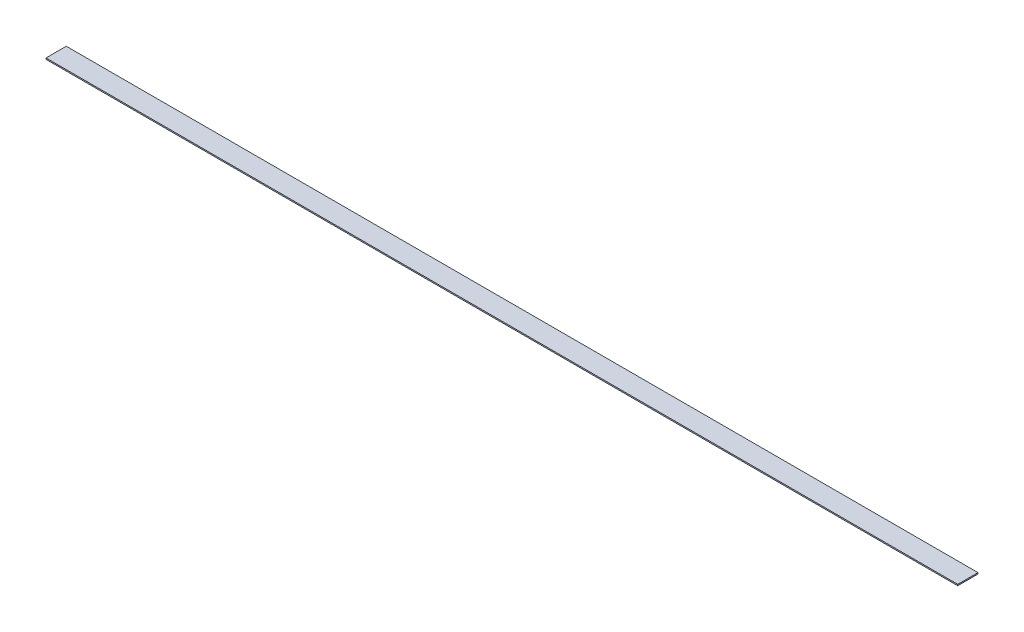
ISO-10303-21;
HEADER;
FILE_DESCRIPTION(('STEP AP214'),'2;1');
FILE_NAME('part.step','',(''),(''),'','','');
FILE_SCHEMA(('AUTOMOTIVE_DESIGN { 1 0 10303 214 1 1 1 1 }'));
ENDSEC;
DATA;
#1=APPLICATION_CONTEXT('core data for automotive mechanical design processes');
#2=APPLICATION_PROTOCOL_DEFINITION('international standard','automotive_design',2000,#1);
#3=PRODUCT_CONTEXT('',#1,'mechanical');
#4=PRODUCT('Part','Part','',(#3));
#5=PRODUCT_RELATED_PRODUCT_CATEGORY('part','',(#4));
#6=PRODUCT_DEFINITION_FORMATION('','',#4);
#7=PRODUCT_DEFINITION_CONTEXT('part definition',#1,'design');
#8=PRODUCT_DEFINITION('design','',#6,#7);
#9=PRODUCT_DEFINITION_SHAPE('','',#8);
#10=(LENGTH_UNIT() NAMED_UNIT(*) SI_UNIT(.MILLI.,.METRE.));
#11=(NAMED_UNIT(*) PLANE_ANGLE_UNIT() SI_UNIT($,.RADIAN.));
#12=(NAMED_UNIT(*) SI_UNIT($,.STERADIAN.) SOLID_ANGLE_UNIT());
#13=UNCERTAINTY_MEASURE_WITH_UNIT(LENGTH_MEASURE(1.E-05),#10,'distance_accuracy_value','');
#14=(GEOMETRIC_REPRESENTATION_CONTEXT(3) GLOBAL_UNCERTAINTY_ASSIGNED_CONTEXT((#13)) GLOBAL_UNIT_ASSIGNED_CONTEXT((#10,
#11,#12)) REPRESENTATION_CONTEXT('',''));
#15=CARTESIAN_POINT('',(0.,0.,0.));
#16=DIRECTION('',(0.,0.,1.));
#17=DIRECTION('',(1.,0.,0.));
#18=AXIS2_PLACEMENT_3D('',#15,#16,#17);
#19=CARTESIAN_POINT('',(0.,1.5875,0.));
#20=DIRECTION('',(1.,0.,0.));
#21=DIRECTION('',(0.,0.,-1.));
#22=AXIS2_PLACEMENT_3D('',#19,#20,#21);
#23=PLANE('',#22);
#24=DIRECTION('',(0.,0.,1.));
#25=VECTOR('',#24,1.);
#26=CARTESIAN_POINT('',(0.,0.,0.));
#27=LINE('',#26,#25);
#28=CARTESIAN_POINT('',(0.,0.,-25.4));
#29=VERTEX_POINT('',#28);
#30=CARTESIAN_POINT('',(0.,0.,0.));
#31=VERTEX_POINT('',#30);
#32=EDGE_CURVE('E96',#29,#31,#27,.T.);
#33=ORIENTED_EDGE('',*,*,#32,.T.);
#34=DIRECTION('',(0.,-1.,0.));
#35=VECTOR('',#34,1.);
#36=CARTESIAN_POINT('',(0.,1.5875,0.));
#37=LINE('',#36,#35);
#38=CARTESIAN_POINT('',(0.,1.5875,0.));
#39=VERTEX_POINT('',#38);
#40=EDGE_CURVE('E11',#39,#31,#37,.T.);
#41=ORIENTED_EDGE('',*,*,#40,.F.);
#42=DIRECTION('',(0.,0.,1.));
#43=VECTOR('',#42,1.);
#44=CARTESIAN_POINT('',(0.,1.5875,0.));
#45=LINE('',#44,#43);
#46=CARTESIAN_POINT('',(0.,1.5875,-25.4));
#47=VERTEX_POINT('',#46);
#48=EDGE_CURVE('E84',#47,#39,#45,.T.);
#49=ORIENTED_EDGE('',*,*,#48,.F.);
#50=DIRECTION('',(0.,-1.,0.));
#51=VECTOR('',#50,1.);
#52=CARTESIAN_POINT('',(0.,1.5875,-25.4));
#53=LINE('',#52,#51);
#54=EDGE_CURVE('E92',#47,#29,#53,.T.);
#55=ORIENTED_EDGE('',*,*,#54,.T.);
#56=EDGE_LOOP('',(#33,#41,#49,#55));
#57=FACE_BOUND('',#56,.T.);
#58=ADVANCED_FACE('F33',(#57),#23,.F.);
#59=CARTESIAN_POINT('',(0.,1.5875,0.));
#60=DIRECTION('',(0.,0.,-1.));
#61=DIRECTION('',(-1.,0.,0.));
#62=AXIS2_PLACEMENT_3D('',#59,#60,#61);
#63=PLANE('',#62);
#64=DIRECTION('',(1.,0.,0.));
#65=VECTOR('',#64,1.);
#66=CARTESIAN_POINT('',(0.,0.,0.));
#67=LINE('',#66,#65);
#68=CARTESIAN_POINT('',(1143.,0.,0.));
#69=VERTEX_POINT('',#68);
#70=EDGE_CURVE('E88',#31,#69,#67,.T.);
#71=ORIENTED_EDGE('',*,*,#70,.T.);
#72=DIRECTION('',(0.,-1.,0.));
#73=VECTOR('',#72,1.);
#74=CARTESIAN_POINT('',(1143.,1.5875,0.));
#75=LINE('',#74,#73);
#76=CARTESIAN_POINT('',(1143.,1.5875,0.));
#77=VERTEX_POINT('',#76);
#78=EDGE_CURVE('E41',#77,#69,#75,.T.);
#79=ORIENTED_EDGE('',*,*,#78,.F.);
#80=DIRECTION('',(1.,0.,0.));
#81=VECTOR('',#80,1.);
#82=CARTESIAN_POINT('',(0.,1.5875,0.));
#83=LINE('',#82,#81);
#84=EDGE_CURVE('E79',#39,#77,#83,.T.);
#85=ORIENTED_EDGE('',*,*,#84,.F.);
#86=ORIENTED_EDGE('',*,*,#40,.T.);
#87=EDGE_LOOP('',(#71,#79,#85,#86));
#88=FACE_BOUND('',#87,.T.);
#89=ADVANCED_FACE('F87',(#88),#63,.F.);
#90=CARTESIAN_POINT('',(1143.,1.5875,0.));
#91=DIRECTION('',(-1.,0.,0.));
#92=DIRECTION('',(0.,0.,1.));
#93=AXIS2_PLACEMENT_3D('',#90,#91,#92);
#94=PLANE('',#93);
#95=DIRECTION('',(0.,0.,-1.));
#96=VECTOR('',#95,1.);
#97=CARTESIAN_POINT('',(1143.,0.,0.));
#98=LINE('',#97,#96);
#99=CARTESIAN_POINT('',(1143.,0.,-25.4));
#100=VERTEX_POINT('',#99);
#101=EDGE_CURVE('E66',#69,#100,#98,.T.);
#102=ORIENTED_EDGE('',*,*,#101,.T.);
#103=DIRECTION('',(0.,-1.,0.));
#104=VECTOR('',#103,1.);
#105=CARTESIAN_POINT('',(1143.,1.5875,-25.4));
#106=LINE('',#105,#104);
#107=CARTESIAN_POINT('',(1143.,1.5875,-25.4));
#108=VERTEX_POINT('',#107);
#109=EDGE_CURVE('E89',#108,#100,#106,.T.);
#110=ORIENTED_EDGE('',*,*,#109,.F.);
#111=DIRECTION('',(0.,0.,-1.));
#112=VECTOR('',#111,1.);
#113=CARTESIAN_POINT('',(1143.,1.5875,0.));
#114=LINE('',#113,#112);
#115=EDGE_CURVE('E82',#77,#108,#114,.T.);
#116=ORIENTED_EDGE('',*,*,#115,.F.);
#117=ORIENTED_EDGE('',*,*,#78,.T.);
#118=EDGE_LOOP('',(#102,#110,#116,#117));
#119=FACE_BOUND('',#118,.T.);
#120=ADVANCED_FACE('F90',(#119),#94,.F.);
#121=CARTESIAN_POINT('',(0.,1.5875,-25.4));
#122=DIRECTION('',(0.,0.,1.));
#123=DIRECTION('',(1.,0.,0.));
#124=AXIS2_PLACEMENT_3D('',#121,#122,#123);
#125=PLANE('',#124);
#126=DIRECTION('',(-1.,0.,0.));
#127=VECTOR('',#126,1.);
#128=CARTESIAN_POINT('',(0.,0.,-25.4));
#129=LINE('',#128,#127);
#130=EDGE_CURVE('E72',#100,#29,#129,.T.);
#131=ORIENTED_EDGE('',*,*,#130,.T.);
#132=ORIENTED_EDGE('',*,*,#54,.F.);
#133=DIRECTION('',(-1.,0.,0.));
#134=VECTOR('',#133,1.);
#135=CARTESIAN_POINT('',(0.,1.5875,-25.4));
#136=LINE('',#135,#134);
#137=EDGE_CURVE('E49',#108,#47,#136,.T.);
#138=ORIENTED_EDGE('',*,*,#137,.F.);
#139=ORIENTED_EDGE('',*,*,#109,.T.);
#140=EDGE_LOOP('',(#131,#132,#138,#139));
#141=FACE_BOUND('',#140,.T.);
#142=ADVANCED_FACE('F103',(#141),#125,.F.);
#143=CARTESIAN_POINT('',(0.,1.5875,0.));
#144=DIRECTION('',(0.,-1.,0.));
#145=DIRECTION('',(0.,0.,-1.));
#146=AXIS2_PLACEMENT_3D('',#143,#144,#145);
#147=PLANE('',#146);
#148=ORIENTED_EDGE('',*,*,#48,.T.);
#149=ORIENTED_EDGE('',*,*,#84,.T.);
#150=ORIENTED_EDGE('',*,*,#115,.T.);
#151=ORIENTED_EDGE('',*,*,#137,.T.);
#152=EDGE_LOOP('',(#148,#149,#150,#151));
#153=FACE_BOUND('',#152,.T.);
#154=ADVANCED_FACE('F80',(#153),#147,.F.);
#155=CARTESIAN_POINT('',(0.,0.,0.));
#156=DIRECTION('',(0.,-1.,0.));
#157=DIRECTION('',(0.,0.,-1.));
#158=AXIS2_PLACEMENT_3D('',#155,#156,#157);
#159=PLANE('',#158);
#160=ORIENTED_EDGE('',*,*,#32,.F.);
#161=ORIENTED_EDGE('',*,*,#130,.F.);
#162=ORIENTED_EDGE('',*,*,#101,.F.);
#163=ORIENTED_EDGE('',*,*,#70,.F.);
#164=EDGE_LOOP('',(#160,#161,#162,#163));
#165=FACE_BOUND('',#164,.T.);
#166=ADVANCED_FACE('F106',(#165),#159,.T.);
#167=CLOSED_SHELL('',(#58,#89,#120,#142,#154,#166));
#168=MANIFOLD_SOLID_BREP('B2',#167);
#169=ADVANCED_BREP_SHAPE_REPRESENTATION('',(#18,#168),#14);
#170=SHAPE_DEFINITION_REPRESENTATION(#9,#169);
ENDSEC;
END-ISO-10303-21;
